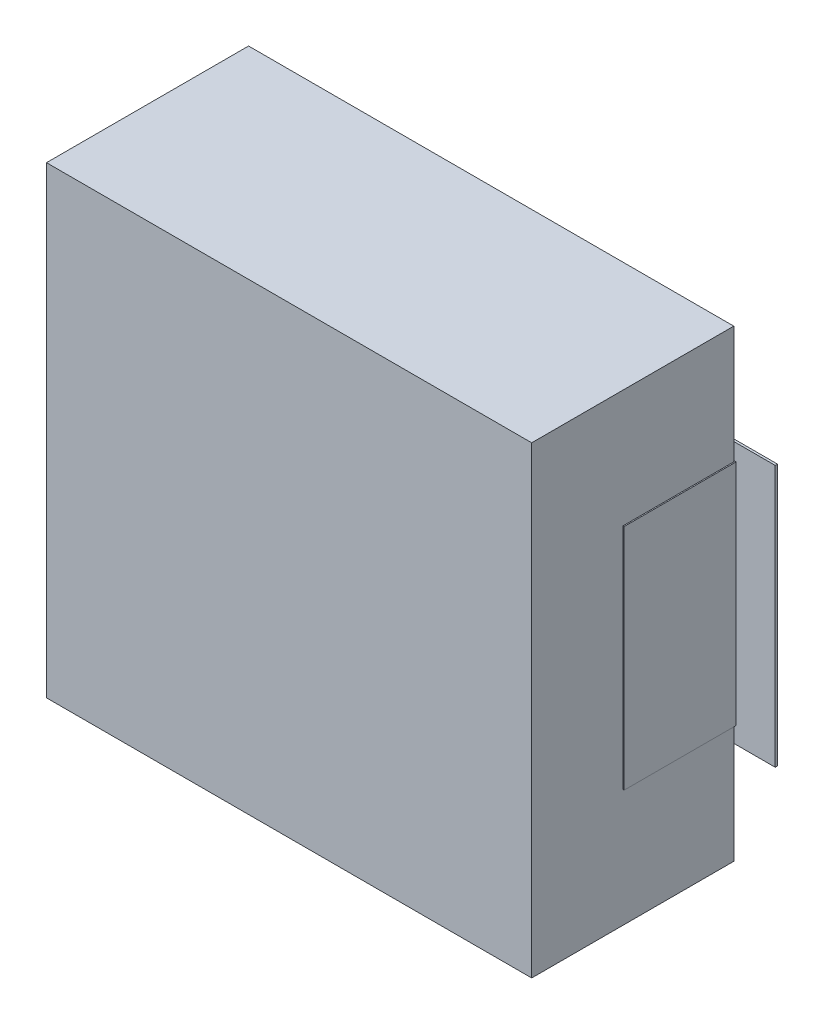
ISO-10303-21;
HEADER;
FILE_DESCRIPTION(('STEP AP214'),'2;1');
FILE_NAME('part.step','',(''),(''),'','','');
FILE_SCHEMA(('AUTOMOTIVE_DESIGN { 1 0 10303 214 1 1 1 1 }'));
ENDSEC;
DATA;
#1=APPLICATION_CONTEXT('core data for automotive mechanical design processes');
#2=APPLICATION_PROTOCOL_DEFINITION('international standard','automotive_design',2000,#1);
#3=PRODUCT_CONTEXT('',#1,'mechanical');
#4=PRODUCT('Part','Part','',(#3));
#5=PRODUCT_RELATED_PRODUCT_CATEGORY('part','',(#4));
#6=PRODUCT_DEFINITION_FORMATION('','',#4);
#7=PRODUCT_DEFINITION_CONTEXT('part definition',#1,'design');
#8=PRODUCT_DEFINITION('design','',#6,#7);
#9=PRODUCT_DEFINITION_SHAPE('','',#8);
#10=(LENGTH_UNIT() NAMED_UNIT(*) SI_UNIT(.MILLI.,.METRE.));
#11=(NAMED_UNIT(*) PLANE_ANGLE_UNIT() SI_UNIT($,.RADIAN.));
#12=(NAMED_UNIT(*) SI_UNIT($,.STERADIAN.) SOLID_ANGLE_UNIT());
#13=UNCERTAINTY_MEASURE_WITH_UNIT(LENGTH_MEASURE(1.E-05),#10,'distance_accuracy_value','');
#14=(GEOMETRIC_REPRESENTATION_CONTEXT(3) GLOBAL_UNCERTAINTY_ASSIGNED_CONTEXT((#13)) GLOBAL_UNIT_ASSIGNED_CONTEXT((#10,
#11,#12)) REPRESENTATION_CONTEXT('',''));
#15=CARTESIAN_POINT('',(0.,0.,0.));
#16=DIRECTION('',(0.,0.,1.));
#17=DIRECTION('',(1.,0.,0.));
#18=AXIS2_PLACEMENT_3D('',#15,#16,#17);
#19=CARTESIAN_POINT('',(1.375,-1.,0.0762));
#20=DIRECTION('',(0.,-1.,0.));
#21=DIRECTION('',(0.,0.,-1.));
#22=AXIS2_PLACEMENT_3D('',#19,#20,#21);
#23=PLANE('',#22);
#24=DIRECTION('',(0.,0.,-1.));
#25=VECTOR('',#24,1.);
#26=CARTESIAN_POINT('',(2.135,-1.,1.0762));
#27=LINE('',#26,#25);
#28=CARTESIAN_POINT('',(2.135,-1.,1.0762));
#29=VERTEX_POINT('',#28);
#30=CARTESIAN_POINT('',(2.135,-1.,0.0962));
#31=VERTEX_POINT('',#30);
#32=EDGE_CURVE('E21',#29,#31,#27,.T.);
#33=ORIENTED_EDGE('',*,*,#32,.F.);
#34=DIRECTION('',(-1.,0.,0.));
#35=VECTOR('',#34,1.);
#36=CARTESIAN_POINT('',(2.135,-1.,1.0762));
#37=LINE('',#36,#35);
#38=CARTESIAN_POINT('',(2.125,-1.,1.0762));
#39=VERTEX_POINT('',#38);
#40=EDGE_CURVE('E316',#29,#39,#37,.T.);
#41=ORIENTED_EDGE('',*,*,#40,.T.);
#42=DIRECTION('',(0.,0.,-1.));
#43=VECTOR('',#42,1.);
#44=CARTESIAN_POINT('',(2.125,-1.,1.0762));
#45=LINE('',#44,#43);
#46=CARTESIAN_POINT('',(2.125,-1.,0.1062));
#47=VERTEX_POINT('',#46);
#48=EDGE_CURVE('E275',#39,#47,#45,.T.);
#49=ORIENTED_EDGE('',*,*,#48,.T.);
#50=DIRECTION('',(-1.,0.,0.));
#51=VECTOR('',#50,1.);
#52=CARTESIAN_POINT('',(2.125,-1.,0.1062));
#53=LINE('',#52,#51);
#54=CARTESIAN_POINT('',(1.375,-1.,0.1062));
#55=VERTEX_POINT('',#54);
#56=EDGE_CURVE('E270',#47,#55,#53,.T.);
#57=ORIENTED_EDGE('',*,*,#56,.T.);
#58=DIRECTION('',(0.,0.,1.));
#59=VECTOR('',#58,1.);
#60=CARTESIAN_POINT('',(1.375,-1.,0.0962));
#61=LINE('',#60,#59);
#62=CARTESIAN_POINT('',(1.375,-1.,0.0962));
#63=VERTEX_POINT('',#62);
#64=EDGE_CURVE('E495',#63,#55,#61,.T.);
#65=ORIENTED_EDGE('',*,*,#64,.F.);
#66=DIRECTION('',(1.,0.,0.));
#67=VECTOR('',#66,1.);
#68=CARTESIAN_POINT('',(1.375,-1.,0.0962));
#69=LINE('',#68,#67);
#70=EDGE_CURVE('E323',#63,#31,#69,.T.);
#71=ORIENTED_EDGE('',*,*,#70,.T.);
#72=EDGE_LOOP('',(#33,#41,#49,#57,#65,#71));
#73=FACE_BOUND('',#72,.T.);
#74=ADVANCED_FACE('F17',(#73),#23,.T.);
#75=CARTESIAN_POINT('',(-2.225,-2.03,0.0762));
#76=DIRECTION('',(0.,-1.,0.));
#77=DIRECTION('',(0.,0.,-1.));
#78=AXIS2_PLACEMENT_3D('',#75,#76,#77);
#79=PLANE('',#78);
#80=DIRECTION('',(1.,0.,0.));
#81=VECTOR('',#80,1.);
#82=CARTESIAN_POINT('',(-2.125,-2.03,0.1062));
#83=LINE('',#82,#81);
#84=CARTESIAN_POINT('',(-2.125,-2.03,0.1062));
#85=VERTEX_POINT('',#84);
#86=CARTESIAN_POINT('',(2.125,-2.03,0.1062));
#87=VERTEX_POINT('',#86);
#88=EDGE_CURVE('E317',#85,#87,#83,.T.);
#89=ORIENTED_EDGE('',*,*,#88,.T.);
#90=DIRECTION('',(0.,0.,1.));
#91=VECTOR('',#90,1.);
#92=CARTESIAN_POINT('',(2.125,-2.03,0.1062));
#93=LINE('',#92,#91);
#94=CARTESIAN_POINT('',(2.125,-2.03,1.8762));
#95=VERTEX_POINT('',#94);
#96=EDGE_CURVE('E276',#87,#95,#93,.T.);
#97=ORIENTED_EDGE('',*,*,#96,.T.);
#98=DIRECTION('',(1.,0.,0.));
#99=VECTOR('',#98,1.);
#100=CARTESIAN_POINT('',(-2.125,-2.03,1.8762));
#101=LINE('',#100,#99);
#102=CARTESIAN_POINT('',(-2.125,-2.03,1.8762));
#103=VERTEX_POINT('',#102);
#104=EDGE_CURVE('E481',#103,#95,#101,.T.);
#105=ORIENTED_EDGE('',*,*,#104,.F.);
#106=DIRECTION('',(0.,0.,1.));
#107=VECTOR('',#106,1.);
#108=CARTESIAN_POINT('',(-2.125,-2.03,0.1062));
#109=LINE('',#108,#107);
#110=EDGE_CURVE('E400',#85,#103,#109,.T.);
#111=ORIENTED_EDGE('',*,*,#110,.F.);
#112=EDGE_LOOP('',(#89,#97,#105,#111));
#113=FACE_BOUND('',#112,.T.);
#114=ADVANCED_FACE('F541',(#113),#79,.T.);
#115=CARTESIAN_POINT('',(-1.375,-1.,0.0762));
#116=DIRECTION('',(1.,0.,0.));
#117=DIRECTION('',(0.,1.,0.));
#118=AXIS2_PLACEMENT_3D('',#115,#116,#117);
#119=PLANE('',#118);
#120=DIRECTION('',(0.,1.,0.));
#121=VECTOR('',#120,1.);
#122=CARTESIAN_POINT('',(-1.375,-1.,0.0962));
#123=LINE('',#122,#121);
#124=CARTESIAN_POINT('',(-1.375,-1.,0.0962));
#125=VERTEX_POINT('',#124);
#126=CARTESIAN_POINT('',(-1.375,1.,0.0962));
#127=VERTEX_POINT('',#126);
#128=EDGE_CURVE('E305',#125,#127,#123,.T.);
#129=ORIENTED_EDGE('',*,*,#128,.T.);
#130=DIRECTION('',(0.,0.,1.));
#131=VECTOR('',#130,1.);
#132=CARTESIAN_POINT('',(-1.375,1.,0.0962));
#133=LINE('',#132,#131);
#134=CARTESIAN_POINT('',(-1.375,1.,0.1062));
#135=VERTEX_POINT('',#134);
#136=EDGE_CURVE('E353',#127,#135,#133,.T.);
#137=ORIENTED_EDGE('',*,*,#136,.T.);
#138=DIRECTION('',(0.,1.,0.));
#139=VECTOR('',#138,1.);
#140=CARTESIAN_POINT('',(-1.375,-1.,0.1062));
#141=LINE('',#140,#139);
#142=CARTESIAN_POINT('',(-1.375,-1.,0.1062));
#143=VERTEX_POINT('',#142);
#144=EDGE_CURVE('E300',#143,#135,#141,.T.);
#145=ORIENTED_EDGE('',*,*,#144,.F.);
#146=DIRECTION('',(0.,0.,1.));
#147=VECTOR('',#146,1.);
#148=CARTESIAN_POINT('',(-1.375,-1.,0.0962));
#149=LINE('',#148,#147);
#150=EDGE_CURVE('E11',#125,#143,#149,.T.);
#151=ORIENTED_EDGE('',*,*,#150,.F.);
#152=EDGE_LOOP('',(#129,#137,#145,#151));
#153=FACE_BOUND('',#152,.T.);
#154=ADVANCED_FACE('F550',(#153),#119,.T.);
#155=CARTESIAN_POINT('',(-2.135,-1.,0.0762));
#156=DIRECTION('',(0.,-1.,0.));
#157=DIRECTION('',(0.,0.,-1.));
#158=AXIS2_PLACEMENT_3D('',#155,#156,#157);
#159=PLANE('',#158);
#160=DIRECTION('',(0.,0.,-1.));
#161=VECTOR('',#160,1.);
#162=CARTESIAN_POINT('',(-2.135,-1.,1.0762));
#163=LINE('',#162,#161);
#164=CARTESIAN_POINT('',(-2.135,-1.,1.0762));
#165=VERTEX_POINT('',#164);
#166=CARTESIAN_POINT('',(-2.135,-1.,0.0962));
#167=VERTEX_POINT('',#166);
#168=EDGE_CURVE('E28',#165,#167,#163,.T.);
#169=ORIENTED_EDGE('',*,*,#168,.T.);
#170=DIRECTION('',(1.,0.,0.));
#171=VECTOR('',#170,1.);
#172=CARTESIAN_POINT('',(-2.135,-1.,0.0962));
#173=LINE('',#172,#171);
#174=EDGE_CURVE('E422',#167,#125,#173,.T.);
#175=ORIENTED_EDGE('',*,*,#174,.T.);
#176=ORIENTED_EDGE('',*,*,#150,.T.);
#177=DIRECTION('',(1.,0.,0.));
#178=VECTOR('',#177,1.);
#179=CARTESIAN_POINT('',(-2.125,-1.,0.1062));
#180=LINE('',#179,#178);
#181=CARTESIAN_POINT('',(-2.125,-1.,0.1062));
#182=VERTEX_POINT('',#181);
#183=EDGE_CURVE('E327',#182,#143,#180,.T.);
#184=ORIENTED_EDGE('',*,*,#183,.F.);
#185=DIRECTION('',(0.,0.,-1.));
#186=VECTOR('',#185,1.);
#187=CARTESIAN_POINT('',(-2.125,-1.,1.0762));
#188=LINE('',#187,#186);
#189=CARTESIAN_POINT('',(-2.125,-1.,1.0762));
#190=VERTEX_POINT('',#189);
#191=EDGE_CURVE('E455',#190,#182,#188,.T.);
#192=ORIENTED_EDGE('',*,*,#191,.F.);
#193=DIRECTION('',(-1.,0.,0.));
#194=VECTOR('',#193,1.);
#195=CARTESIAN_POINT('',(-2.125,-1.,1.0762));
#196=LINE('',#195,#194);
#197=EDGE_CURVE('E386',#190,#165,#196,.T.);
#198=ORIENTED_EDGE('',*,*,#197,.T.);
#199=EDGE_LOOP('',(#169,#175,#176,#184,#192,#198));
#200=FACE_BOUND('',#199,.T.);
#201=ADVANCED_FACE('F624',(#200),#159,.T.);
#202=CARTESIAN_POINT('',(-2.135,1.,0.0762));
#203=DIRECTION('',(-1.,0.,0.));
#204=DIRECTION('',(0.,0.,1.));
#205=AXIS2_PLACEMENT_3D('',#202,#203,#204);
#206=PLANE('',#205);
#207=DIRECTION('',(0.,0.,-1.));
#208=VECTOR('',#207,1.);
#209=CARTESIAN_POINT('',(-2.135,1.,1.0762));
#210=LINE('',#209,#208);
#211=CARTESIAN_POINT('',(-2.135,1.,1.0762));
#212=VERTEX_POINT('',#211);
#213=CARTESIAN_POINT('',(-2.135,1.,0.0962));
#214=VERTEX_POINT('',#213);
#215=EDGE_CURVE('E399',#212,#214,#210,.T.);
#216=ORIENTED_EDGE('',*,*,#215,.T.);
#217=DIRECTION('',(0.,-1.,0.));
#218=VECTOR('',#217,1.);
#219=CARTESIAN_POINT('',(-2.135,1.,0.0962));
#220=LINE('',#219,#218);
#221=EDGE_CURVE('E306',#214,#167,#220,.T.);
#222=ORIENTED_EDGE('',*,*,#221,.T.);
#223=ORIENTED_EDGE('',*,*,#168,.F.);
#224=DIRECTION('',(0.,1.,0.));
#225=VECTOR('',#224,1.);
#226=CARTESIAN_POINT('',(-2.135,-1.,1.0762));
#227=LINE('',#226,#225);
#228=EDGE_CURVE('E407',#165,#212,#227,.T.);
#229=ORIENTED_EDGE('',*,*,#228,.T.);
#230=EDGE_LOOP('',(#216,#222,#223,#229));
#231=FACE_BOUND('',#230,.T.);
#232=ADVANCED_FACE('F555',(#231),#206,.T.);
#233=CARTESIAN_POINT('',(-1.375,1.,0.0762));
#234=DIRECTION('',(0.,1.,0.));
#235=DIRECTION('',(1.,0.,0.));
#236=AXIS2_PLACEMENT_3D('',#233,#234,#235);
#237=PLANE('',#236);
#238=ORIENTED_EDGE('',*,*,#215,.F.);
#239=DIRECTION('',(1.,0.,0.));
#240=VECTOR('',#239,1.);
#241=CARTESIAN_POINT('',(-2.135,1.,1.0762));
#242=LINE('',#241,#240);
#243=CARTESIAN_POINT('',(-2.125,1.,1.0762));
#244=VERTEX_POINT('',#243);
#245=EDGE_CURVE('E359',#212,#244,#242,.T.);
#246=ORIENTED_EDGE('',*,*,#245,.T.);
#247=DIRECTION('',(0.,0.,-1.));
#248=VECTOR('',#247,1.);
#249=CARTESIAN_POINT('',(-2.125,1.,1.0762));
#250=LINE('',#249,#248);
#251=CARTESIAN_POINT('',(-2.125,1.,0.1062));
#252=VERTEX_POINT('',#251);
#253=EDGE_CURVE('E396',#244,#252,#250,.T.);
#254=ORIENTED_EDGE('',*,*,#253,.T.);
#255=DIRECTION('',(1.,0.,0.));
#256=VECTOR('',#255,1.);
#257=CARTESIAN_POINT('',(-2.125,1.,0.1062));
#258=LINE('',#257,#256);
#259=EDGE_CURVE('E295',#252,#135,#258,.T.);
#260=ORIENTED_EDGE('',*,*,#259,.T.);
#261=ORIENTED_EDGE('',*,*,#136,.F.);
#262=DIRECTION('',(-1.,0.,0.));
#263=VECTOR('',#262,1.);
#264=CARTESIAN_POINT('',(-1.375,1.,0.0962));
#265=LINE('',#264,#263);
#266=EDGE_CURVE('E301',#127,#214,#265,.T.);
#267=ORIENTED_EDGE('',*,*,#266,.T.);
#268=EDGE_LOOP('',(#238,#246,#254,#260,#261,#267));
#269=FACE_BOUND('',#268,.T.);
#270=ADVANCED_FACE('F639',(#269),#237,.T.);
#271=CARTESIAN_POINT('',(-2.125,-2.03,1.8762));
#272=DIRECTION('',(1.,0.,0.));
#273=DIRECTION('',(0.,1.,0.));
#274=AXIS2_PLACEMENT_3D('',#271,#272,#273);
#275=PLANE('',#274);
#276=DIRECTION('',(0.,-1.,0.));
#277=VECTOR('',#276,1.);
#278=CARTESIAN_POINT('',(-2.125,1.,1.0762));
#279=LINE('',#278,#277);
#280=EDGE_CURVE('E355',#244,#190,#279,.T.);
#281=ORIENTED_EDGE('',*,*,#280,.T.);
#282=ORIENTED_EDGE('',*,*,#191,.T.);
#283=DIRECTION('',(0.,-1.,0.));
#284=VECTOR('',#283,1.);
#285=CARTESIAN_POINT('',(-2.125,-1.,0.1062));
#286=LINE('',#285,#284);
#287=EDGE_CURVE('E320',#182,#85,#286,.T.);
#288=ORIENTED_EDGE('',*,*,#287,.T.);
#289=ORIENTED_EDGE('',*,*,#110,.T.);
#290=DIRECTION('',(0.,1.,0.));
#291=VECTOR('',#290,1.);
#292=CARTESIAN_POINT('',(-2.125,-2.03,1.8762));
#293=LINE('',#292,#291);
#294=CARTESIAN_POINT('',(-2.125,2.03,1.8762));
#295=VERTEX_POINT('',#294);
#296=EDGE_CURVE('E415',#103,#295,#293,.T.);
#297=ORIENTED_EDGE('',*,*,#296,.T.);
#298=DIRECTION('',(0.,0.,1.));
#299=VECTOR('',#298,1.);
#300=CARTESIAN_POINT('',(-2.125,2.03,0.1062));
#301=LINE('',#300,#299);
#302=CARTESIAN_POINT('',(-2.125,2.03,0.1062));
#303=VERTEX_POINT('',#302);
#304=EDGE_CURVE('E42',#303,#295,#301,.T.);
#305=ORIENTED_EDGE('',*,*,#304,.F.);
#306=DIRECTION('',(0.,-1.,0.));
#307=VECTOR('',#306,1.);
#308=CARTESIAN_POINT('',(-2.125,2.03,0.1062));
#309=LINE('',#308,#307);
#310=EDGE_CURVE('E299',#303,#252,#309,.T.);
#311=ORIENTED_EDGE('',*,*,#310,.T.);
#312=ORIENTED_EDGE('',*,*,#253,.F.);
#313=EDGE_LOOP('',(#281,#282,#288,#289,#297,#305,#311,#312));
#314=FACE_BOUND('',#313,.T.);
#315=ADVANCED_FACE('F651',(#314),#275,.F.);
#316=CARTESIAN_POINT('',(2.225,2.03,0.0762));
#317=DIRECTION('',(0.,1.,0.));
#318=DIRECTION('',(1.,0.,0.));
#319=AXIS2_PLACEMENT_3D('',#316,#317,#318);
#320=PLANE('',#319);
#321=DIRECTION('',(-1.,0.,0.));
#322=VECTOR('',#321,1.);
#323=CARTESIAN_POINT('',(2.125,2.03,0.1062));
#324=LINE('',#323,#322);
#325=CARTESIAN_POINT('',(2.125,2.03,0.1062));
#326=VERTEX_POINT('',#325);
#327=EDGE_CURVE('E456',#326,#303,#324,.T.);
#328=ORIENTED_EDGE('',*,*,#327,.T.);
#329=ORIENTED_EDGE('',*,*,#304,.T.);
#330=DIRECTION('',(-1.,0.,0.));
#331=VECTOR('',#330,1.);
#332=CARTESIAN_POINT('',(2.125,2.03,1.8762));
#333=LINE('',#332,#331);
#334=CARTESIAN_POINT('',(2.125,2.03,1.8762));
#335=VERTEX_POINT('',#334);
#336=EDGE_CURVE('E374',#335,#295,#333,.T.);
#337=ORIENTED_EDGE('',*,*,#336,.F.);
#338=DIRECTION('',(0.,0.,1.));
#339=VECTOR('',#338,1.);
#340=CARTESIAN_POINT('',(2.125,2.03,0.1062));
#341=LINE('',#340,#339);
#342=EDGE_CURVE('E311',#326,#335,#341,.T.);
#343=ORIENTED_EDGE('',*,*,#342,.F.);
#344=EDGE_LOOP('',(#328,#329,#337,#343));
#345=FACE_BOUND('',#344,.T.);
#346=ADVANCED_FACE('F691',(#345),#320,.T.);
#347=CARTESIAN_POINT('',(0.,0.,0.1062));
#348=DIRECTION('',(0.,0.,-1.));
#349=DIRECTION('',(0.,-1.,0.));
#350=AXIS2_PLACEMENT_3D('',#347,#348,#349);
#351=PLANE('',#350);
#352=DIRECTION('',(0.,-1.,0.));
#353=VECTOR('',#352,1.);
#354=CARTESIAN_POINT('',(2.125,2.03,0.1062));
#355=LINE('',#354,#353);
#356=CARTESIAN_POINT('',(2.125,1.,0.1062));
#357=VERTEX_POINT('',#356);
#358=EDGE_CURVE('E307',#326,#357,#355,.T.);
#359=ORIENTED_EDGE('',*,*,#358,.T.);
#360=DIRECTION('',(-1.,0.,0.));
#361=VECTOR('',#360,1.);
#362=CARTESIAN_POINT('',(2.125,1.,0.1062));
#363=LINE('',#362,#361);
#364=CARTESIAN_POINT('',(1.375,1.,0.1062));
#365=VERTEX_POINT('',#364);
#366=EDGE_CURVE('E329',#357,#365,#363,.T.);
#367=ORIENTED_EDGE('',*,*,#366,.T.);
#368=DIRECTION('',(0.,-1.,0.));
#369=VECTOR('',#368,1.);
#370=CARTESIAN_POINT('',(1.375,1.,0.1062));
#371=LINE('',#370,#369);
#372=EDGE_CURVE('E500',#365,#55,#371,.T.);
#373=ORIENTED_EDGE('',*,*,#372,.T.);
#374=ORIENTED_EDGE('',*,*,#56,.F.);
#375=DIRECTION('',(0.,-1.,0.));
#376=VECTOR('',#375,1.);
#377=CARTESIAN_POINT('',(2.125,-1.,0.1062));
#378=LINE('',#377,#376);
#379=EDGE_CURVE('E272',#47,#87,#378,.T.);
#380=ORIENTED_EDGE('',*,*,#379,.T.);
#381=ORIENTED_EDGE('',*,*,#88,.F.);
#382=ORIENTED_EDGE('',*,*,#287,.F.);
#383=ORIENTED_EDGE('',*,*,#183,.T.);
#384=ORIENTED_EDGE('',*,*,#144,.T.);
#385=ORIENTED_EDGE('',*,*,#259,.F.);
#386=ORIENTED_EDGE('',*,*,#310,.F.);
#387=ORIENTED_EDGE('',*,*,#327,.F.);
#388=EDGE_LOOP('',(#359,#367,#373,#374,#380,#381,#382,#383,#384,#385,#386,#387));
#389=FACE_BOUND('',#388,.T.);
#390=ADVANCED_FACE('F536',(#389),#351,.T.);
#391=CARTESIAN_POINT('',(1.375,1.,0.0762));
#392=DIRECTION('',(-1.,0.,0.));
#393=DIRECTION('',(0.,0.,1.));
#394=AXIS2_PLACEMENT_3D('',#391,#392,#393);
#395=PLANE('',#394);
#396=DIRECTION('',(0.,-1.,0.));
#397=VECTOR('',#396,1.);
#398=CARTESIAN_POINT('',(1.375,1.,0.0962));
#399=LINE('',#398,#397);
#400=CARTESIAN_POINT('',(1.375,1.,0.0962));
#401=VERTEX_POINT('',#400);
#402=EDGE_CURVE('E366',#401,#63,#399,.T.);
#403=ORIENTED_EDGE('',*,*,#402,.T.);
#404=ORIENTED_EDGE('',*,*,#64,.T.);
#405=ORIENTED_EDGE('',*,*,#372,.F.);
#406=DIRECTION('',(0.,0.,1.));
#407=VECTOR('',#406,1.);
#408=CARTESIAN_POINT('',(1.375,1.,0.0962));
#409=LINE('',#408,#407);
#410=EDGE_CURVE('E332',#401,#365,#409,.T.);
#411=ORIENTED_EDGE('',*,*,#410,.F.);
#412=EDGE_LOOP('',(#403,#404,#405,#411));
#413=FACE_BOUND('',#412,.T.);
#414=ADVANCED_FACE('F527',(#413),#395,.T.);
#415=CARTESIAN_POINT('',(2.478,-1.145,0.0762));
#416=DIRECTION('',(1.,0.,0.));
#417=DIRECTION('',(0.,1.,0.));
#418=AXIS2_PLACEMENT_3D('',#415,#416,#417);
#419=PLANE('',#418);
#420=DIRECTION('',(0.,1.,0.));
#421=VECTOR('',#420,1.);
#422=CARTESIAN_POINT('',(2.478,-1.145,0.0762));
#423=LINE('',#422,#421);
#424=CARTESIAN_POINT('',(2.478,-1.145,0.0762));
#425=VERTEX_POINT('',#424);
#426=CARTESIAN_POINT('',(2.478,1.145,0.0762));
#427=VERTEX_POINT('',#426);
#428=EDGE_CURVE('E285',#425,#427,#423,.T.);
#429=ORIENTED_EDGE('',*,*,#428,.T.);
#430=DIRECTION('',(0.,0.,1.));
#431=VECTOR('',#430,1.);
#432=CARTESIAN_POINT('',(2.478,1.145,0.0762));
#433=LINE('',#432,#431);
#434=CARTESIAN_POINT('',(2.478,1.145,0.0962));
#435=VERTEX_POINT('',#434);
#436=EDGE_CURVE('E383',#427,#435,#433,.T.);
#437=ORIENTED_EDGE('',*,*,#436,.T.);
#438=DIRECTION('',(0.,1.,0.));
#439=VECTOR('',#438,1.);
#440=CARTESIAN_POINT('',(2.478,-1.145,0.0962));
#441=LINE('',#440,#439);
#442=CARTESIAN_POINT('',(2.478,-1.145,0.0962));
#443=VERTEX_POINT('',#442);
#444=EDGE_CURVE('E255',#443,#435,#441,.T.);
#445=ORIENTED_EDGE('',*,*,#444,.F.);
#446=DIRECTION('',(0.,0.,1.));
#447=VECTOR('',#446,1.);
#448=CARTESIAN_POINT('',(2.478,-1.145,0.0762));
#449=LINE('',#448,#447);
#450=EDGE_CURVE('E245',#425,#443,#449,.T.);
#451=ORIENTED_EDGE('',*,*,#450,.F.);
#452=EDGE_LOOP('',(#429,#437,#445,#451));
#453=FACE_BOUND('',#452,.T.);
#454=ADVANCED_FACE('F525',(#453),#419,.T.);
#455=CARTESIAN_POINT('',(1.078,-1.145,0.0762));
#456=DIRECTION('',(0.,-1.,0.));
#457=DIRECTION('',(0.,0.,-1.));
#458=AXIS2_PLACEMENT_3D('',#455,#456,#457);
#459=PLANE('',#458);
#460=DIRECTION('',(1.,0.,0.));
#461=VECTOR('',#460,1.);
#462=CARTESIAN_POINT('',(1.078,-1.145,0.0762));
#463=LINE('',#462,#461);
#464=CARTESIAN_POINT('',(1.078,-1.145,0.0762));
#465=VERTEX_POINT('',#464);
#466=EDGE_CURVE('E278',#465,#425,#463,.T.);
#467=ORIENTED_EDGE('',*,*,#466,.T.);
#468=ORIENTED_EDGE('',*,*,#450,.T.);
#469=DIRECTION('',(1.,0.,0.));
#470=VECTOR('',#469,1.);
#471=CARTESIAN_POINT('',(1.078,-1.145,0.0962));
#472=LINE('',#471,#470);
#473=CARTESIAN_POINT('',(1.078,-1.145,0.0962));
#474=VERTEX_POINT('',#473);
#475=EDGE_CURVE('E249',#474,#443,#472,.T.);
#476=ORIENTED_EDGE('',*,*,#475,.F.);
#477=DIRECTION('',(0.,0.,1.));
#478=VECTOR('',#477,1.);
#479=CARTESIAN_POINT('',(1.078,-1.145,0.0762));
#480=LINE('',#479,#478);
#481=EDGE_CURVE('E233',#465,#474,#480,.T.);
#482=ORIENTED_EDGE('',*,*,#481,.F.);
#483=EDGE_LOOP('',(#467,#468,#476,#482));
#484=FACE_BOUND('',#483,.T.);
#485=ADVANCED_FACE('F250',(#484),#459,.T.);
#486=CARTESIAN_POINT('',(1.078,1.145,0.0762));
#487=DIRECTION('',(-1.,0.,0.));
#488=DIRECTION('',(0.,0.,1.));
#489=AXIS2_PLACEMENT_3D('',#486,#487,#488);
#490=PLANE('',#489);
#491=DIRECTION('',(0.,-1.,0.));
#492=VECTOR('',#491,1.);
#493=CARTESIAN_POINT('',(1.078,1.145,0.0762));
#494=LINE('',#493,#492);
#495=CARTESIAN_POINT('',(1.078,1.145,0.0762));
#496=VERTEX_POINT('',#495);
#497=EDGE_CURVE('E240',#496,#465,#494,.T.);
#498=ORIENTED_EDGE('',*,*,#497,.T.);
#499=ORIENTED_EDGE('',*,*,#481,.T.);
#500=DIRECTION('',(0.,-1.,0.));
#501=VECTOR('',#500,1.);
#502=CARTESIAN_POINT('',(1.078,1.145,0.0962));
#503=LINE('',#502,#501);
#504=CARTESIAN_POINT('',(1.078,1.145,0.0962));
#505=VERTEX_POINT('',#504);
#506=EDGE_CURVE('E238',#505,#474,#503,.T.);
#507=ORIENTED_EDGE('',*,*,#506,.F.);
#508=DIRECTION('',(0.,0.,1.));
#509=VECTOR('',#508,1.);
#510=CARTESIAN_POINT('',(1.078,1.145,0.0762));
#511=LINE('',#510,#509);
#512=EDGE_CURVE('E402',#496,#505,#511,.T.);
#513=ORIENTED_EDGE('',*,*,#512,.F.);
#514=EDGE_LOOP('',(#498,#499,#507,#513));
#515=FACE_BOUND('',#514,.T.);
#516=ADVANCED_FACE('F235',(#515),#490,.T.);
#517=CARTESIAN_POINT('',(-2.478,1.145,0.0762));
#518=DIRECTION('',(-1.,0.,0.));
#519=DIRECTION('',(0.,0.,1.));
#520=AXIS2_PLACEMENT_3D('',#517,#518,#519);
#521=PLANE('',#520);
#522=DIRECTION('',(0.,-1.,0.));
#523=VECTOR('',#522,1.);
#524=CARTESIAN_POINT('',(-2.478,1.145,0.0762));
#525=LINE('',#524,#523);
#526=CARTESIAN_POINT('',(-2.478,1.145,0.0762));
#527=VERTEX_POINT('',#526);
#528=CARTESIAN_POINT('',(-2.478,-1.145,0.0762));
#529=VERTEX_POINT('',#528);
#530=EDGE_CURVE('E291',#527,#529,#525,.T.);
#531=ORIENTED_EDGE('',*,*,#530,.T.);
#532=DIRECTION('',(0.,0.,1.));
#533=VECTOR('',#532,1.);
#534=CARTESIAN_POINT('',(-2.478,-1.145,0.0762));
#535=LINE('',#534,#533);
#536=CARTESIAN_POINT('',(-2.478,-1.145,0.0962));
#537=VERTEX_POINT('',#536);
#538=EDGE_CURVE('E246',#529,#537,#535,.T.);
#539=ORIENTED_EDGE('',*,*,#538,.T.);
#540=DIRECTION('',(0.,-1.,0.));
#541=VECTOR('',#540,1.);
#542=CARTESIAN_POINT('',(-2.478,1.145,0.0962));
#543=LINE('',#542,#541);
#544=CARTESIAN_POINT('',(-2.478,1.145,0.0962));
#545=VERTEX_POINT('',#544);
#546=EDGE_CURVE('E365',#545,#537,#543,.T.);
#547=ORIENTED_EDGE('',*,*,#546,.F.);
#548=DIRECTION('',(0.,0.,1.));
#549=VECTOR('',#548,1.);
#550=CARTESIAN_POINT('',(-2.478,1.145,0.0762));
#551=LINE('',#550,#549);
#552=EDGE_CURVE('E156',#527,#545,#551,.T.);
#553=ORIENTED_EDGE('',*,*,#552,.F.);
#554=EDGE_LOOP('',(#531,#539,#547,#553));
#555=FACE_BOUND('',#554,.T.);
#556=ADVANCED_FACE('F19',(#555),#521,.T.);
#557=CARTESIAN_POINT('',(-2.478,-1.145,0.0762));
#558=DIRECTION('',(0.,-1.,0.));
#559=DIRECTION('',(0.,0.,-1.));
#560=AXIS2_PLACEMENT_3D('',#557,#558,#559);
#561=PLANE('',#560);
#562=DIRECTION('',(1.,0.,0.));
#563=VECTOR('',#562,1.);
#564=CARTESIAN_POINT('',(-2.478,-1.145,0.0762));
#565=LINE('',#564,#563);
#566=CARTESIAN_POINT('',(-1.078,-1.145,0.0762));
#567=VERTEX_POINT('',#566);
#568=EDGE_CURVE('E390',#529,#567,#565,.T.);
#569=ORIENTED_EDGE('',*,*,#568,.T.);
#570=DIRECTION('',(0.,0.,1.));
#571=VECTOR('',#570,1.);
#572=CARTESIAN_POINT('',(-1.078,-1.145,0.0762));
#573=LINE('',#572,#571);
#574=CARTESIAN_POINT('',(-1.078,-1.145,0.0962));
#575=VERTEX_POINT('',#574);
#576=EDGE_CURVE('E142',#567,#575,#573,.T.);
#577=ORIENTED_EDGE('',*,*,#576,.T.);
#578=DIRECTION('',(1.,0.,0.));
#579=VECTOR('',#578,1.);
#580=CARTESIAN_POINT('',(-2.478,-1.145,0.0962));
#581=LINE('',#580,#579);
#582=EDGE_CURVE('E370',#537,#575,#581,.T.);
#583=ORIENTED_EDGE('',*,*,#582,.F.);
#584=ORIENTED_EDGE('',*,*,#538,.F.);
#585=EDGE_LOOP('',(#569,#577,#583,#584));
#586=FACE_BOUND('',#585,.T.);
#587=ADVANCED_FACE('F592',(#586),#561,.T.);
#588=CARTESIAN_POINT('',(-1.078,-1.145,0.0762));
#589=DIRECTION('',(1.,0.,0.));
#590=DIRECTION('',(0.,1.,0.));
#591=AXIS2_PLACEMENT_3D('',#588,#589,#590);
#592=PLANE('',#591);
#593=DIRECTION('',(0.,1.,0.));
#594=VECTOR('',#593,1.);
#595=CARTESIAN_POINT('',(-1.078,-1.145,0.0762));
#596=LINE('',#595,#594);
#597=CARTESIAN_POINT('',(-1.078,1.145,0.0762));
#598=VERTEX_POINT('',#597);
#599=EDGE_CURVE('E382',#567,#598,#596,.T.);
#600=ORIENTED_EDGE('',*,*,#599,.T.);
#601=DIRECTION('',(0.,0.,1.));
#602=VECTOR('',#601,1.);
#603=CARTESIAN_POINT('',(-1.078,1.145,0.0762));
#604=LINE('',#603,#602);
#605=CARTESIAN_POINT('',(-1.078,1.145,0.0962));
#606=VERTEX_POINT('',#605);
#607=EDGE_CURVE('E283',#598,#606,#604,.T.);
#608=ORIENTED_EDGE('',*,*,#607,.T.);
#609=DIRECTION('',(0.,1.,0.));
#610=VECTOR('',#609,1.);
#611=CARTESIAN_POINT('',(-1.078,-1.145,0.0962));
#612=LINE('',#611,#610);
#613=EDGE_CURVE('E451',#575,#606,#612,.T.);
#614=ORIENTED_EDGE('',*,*,#613,.F.);
#615=ORIENTED_EDGE('',*,*,#576,.F.);
#616=EDGE_LOOP('',(#600,#608,#614,#615));
#617=FACE_BOUND('',#616,.T.);
#618=ADVANCED_FACE('F602',(#617),#592,.T.);
#619=CARTESIAN_POINT('',(-1.078,1.145,0.0762));
#620=DIRECTION('',(0.,1.,0.));
#621=DIRECTION('',(1.,0.,0.));
#622=AXIS2_PLACEMENT_3D('',#619,#620,#621);
#623=PLANE('',#622);
#624=DIRECTION('',(-1.,0.,0.));
#625=VECTOR('',#624,1.);
#626=CARTESIAN_POINT('',(-1.078,1.145,0.0762));
#627=LINE('',#626,#625);
#628=EDGE_CURVE('E378',#598,#527,#627,.T.);
#629=ORIENTED_EDGE('',*,*,#628,.T.);
#630=ORIENTED_EDGE('',*,*,#552,.T.);
#631=DIRECTION('',(-1.,0.,0.));
#632=VECTOR('',#631,1.);
#633=CARTESIAN_POINT('',(-1.078,1.145,0.0962));
#634=LINE('',#633,#632);
#635=EDGE_CURVE('E361',#606,#545,#634,.T.);
#636=ORIENTED_EDGE('',*,*,#635,.F.);
#637=ORIENTED_EDGE('',*,*,#607,.F.);
#638=EDGE_LOOP('',(#629,#630,#636,#637));
#639=FACE_BOUND('',#638,.T.);
#640=ADVANCED_FACE('F597',(#639),#623,.T.);
#641=CARTESIAN_POINT('',(0.,0.,0.0762));
#642=DIRECTION('',(0.,0.,1.));
#643=DIRECTION('',(1.,0.,0.));
#644=AXIS2_PLACEMENT_3D('',#641,#642,#643);
#645=PLANE('',#644);
#646=DIRECTION('',(-1.,0.,0.));
#647=VECTOR('',#646,1.);
#648=CARTESIAN_POINT('',(2.478,1.145,0.0762));
#649=LINE('',#648,#647);
#650=EDGE_CURVE('E426',#427,#496,#649,.T.);
#651=ORIENTED_EDGE('',*,*,#650,.F.);
#652=ORIENTED_EDGE('',*,*,#428,.F.);
#653=ORIENTED_EDGE('',*,*,#466,.F.);
#654=ORIENTED_EDGE('',*,*,#497,.F.);
#655=EDGE_LOOP('',(#651,#652,#653,#654));
#656=FACE_BOUND('',#655,.T.);
#657=ADVANCED_FACE('F523',(#656),#645,.F.);
#658=CARTESIAN_POINT('',(0.,0.,0.0762));
#659=DIRECTION('',(0.,0.,1.));
#660=DIRECTION('',(1.,0.,0.));
#661=AXIS2_PLACEMENT_3D('',#658,#659,#660);
#662=PLANE('',#661);
#663=ORIENTED_EDGE('',*,*,#628,.F.);
#664=ORIENTED_EDGE('',*,*,#599,.F.);
#665=ORIENTED_EDGE('',*,*,#568,.F.);
#666=ORIENTED_EDGE('',*,*,#530,.F.);
#667=EDGE_LOOP('',(#663,#664,#665,#666));
#668=FACE_BOUND('',#667,.T.);
#669=ADVANCED_FACE('F601',(#668),#662,.F.);
#670=CARTESIAN_POINT('',(2.478,1.145,0.0762));
#671=DIRECTION('',(0.,1.,0.));
#672=DIRECTION('',(1.,0.,0.));
#673=AXIS2_PLACEMENT_3D('',#670,#671,#672);
#674=PLANE('',#673);
#675=ORIENTED_EDGE('',*,*,#650,.T.);
#676=ORIENTED_EDGE('',*,*,#512,.T.);
#677=DIRECTION('',(-1.,0.,0.));
#678=VECTOR('',#677,1.);
#679=CARTESIAN_POINT('',(2.478,1.145,0.0962));
#680=LINE('',#679,#678);
#681=EDGE_CURVE('E259',#435,#505,#680,.T.);
#682=ORIENTED_EDGE('',*,*,#681,.F.);
#683=ORIENTED_EDGE('',*,*,#436,.F.);
#684=EDGE_LOOP('',(#675,#676,#682,#683));
#685=FACE_BOUND('',#684,.T.);
#686=ADVANCED_FACE('F519',(#685),#674,.T.);
#687=CARTESIAN_POINT('',(0.,0.,0.0962));
#688=DIRECTION('',(0.,0.,1.));
#689=DIRECTION('',(1.,0.,0.));
#690=AXIS2_PLACEMENT_3D('',#687,#688,#689);
#691=PLANE('',#690);
#692=ORIENTED_EDGE('',*,*,#221,.F.);
#693=ORIENTED_EDGE('',*,*,#266,.F.);
#694=ORIENTED_EDGE('',*,*,#128,.F.);
#695=ORIENTED_EDGE('',*,*,#174,.F.);
#696=EDGE_LOOP('',(#692,#693,#694,#695));
#697=FACE_BOUND('',#696,.T.);
#698=ORIENTED_EDGE('',*,*,#635,.T.);
#699=ORIENTED_EDGE('',*,*,#546,.T.);
#700=ORIENTED_EDGE('',*,*,#582,.T.);
#701=ORIENTED_EDGE('',*,*,#613,.T.);
#702=EDGE_LOOP('',(#698,#699,#700,#701));
#703=FACE_BOUND('',#702,.T.);
#704=ADVANCED_FACE('F567',(#697,#703),#691,.T.);
#705=CARTESIAN_POINT('',(0.,0.,0.0962));
#706=DIRECTION('',(0.,0.,1.));
#707=DIRECTION('',(1.,0.,0.));
#708=AXIS2_PLACEMENT_3D('',#705,#706,#707);
#709=PLANE('',#708);
#710=DIRECTION('',(-1.,0.,0.));
#711=VECTOR('',#710,1.);
#712=CARTESIAN_POINT('',(2.135,1.,0.0962));
#713=LINE('',#712,#711);
#714=CARTESIAN_POINT('',(2.135,1.,0.0962));
#715=VERTEX_POINT('',#714);
#716=EDGE_CURVE('E341',#715,#401,#713,.T.);
#717=ORIENTED_EDGE('',*,*,#716,.F.);
#718=DIRECTION('',(0.,1.,0.));
#719=VECTOR('',#718,1.);
#720=CARTESIAN_POINT('',(2.135,-1.,0.0962));
#721=LINE('',#720,#719);
#722=EDGE_CURVE('E266',#31,#715,#721,.T.);
#723=ORIENTED_EDGE('',*,*,#722,.F.);
#724=ORIENTED_EDGE('',*,*,#70,.F.);
#725=ORIENTED_EDGE('',*,*,#402,.F.);
#726=EDGE_LOOP('',(#717,#723,#724,#725));
#727=FACE_BOUND('',#726,.T.);
#728=ORIENTED_EDGE('',*,*,#681,.T.);
#729=ORIENTED_EDGE('',*,*,#506,.T.);
#730=ORIENTED_EDGE('',*,*,#475,.T.);
#731=ORIENTED_EDGE('',*,*,#444,.T.);
#732=EDGE_LOOP('',(#728,#729,#730,#731));
#733=FACE_BOUND('',#732,.T.);
#734=ADVANCED_FACE('F257',(#727,#733),#709,.T.);
#735=CARTESIAN_POINT('',(2.135,-1.,0.0762));
#736=DIRECTION('',(1.,0.,0.));
#737=DIRECTION('',(0.,1.,0.));
#738=AXIS2_PLACEMENT_3D('',#735,#736,#737);
#739=PLANE('',#738);
#740=DIRECTION('',(0.,0.,-1.));
#741=VECTOR('',#740,1.);
#742=CARTESIAN_POINT('',(2.135,1.,1.0762));
#743=LINE('',#742,#741);
#744=CARTESIAN_POINT('',(2.135,1.,1.0762));
#745=VERTEX_POINT('',#744);
#746=EDGE_CURVE('E349',#745,#715,#743,.T.);
#747=ORIENTED_EDGE('',*,*,#746,.F.);
#748=DIRECTION('',(0.,-1.,0.));
#749=VECTOR('',#748,1.);
#750=CARTESIAN_POINT('',(2.135,1.,1.0762));
#751=LINE('',#750,#749);
#752=EDGE_CURVE('E416',#745,#29,#751,.T.);
#753=ORIENTED_EDGE('',*,*,#752,.T.);
#754=ORIENTED_EDGE('',*,*,#32,.T.);
#755=ORIENTED_EDGE('',*,*,#722,.T.);
#756=EDGE_LOOP('',(#747,#753,#754,#755));
#757=FACE_BOUND('',#756,.T.);
#758=ADVANCED_FACE('F557',(#757),#739,.T.);
#759=CARTESIAN_POINT('',(2.135,1.,0.0762));
#760=DIRECTION('',(0.,1.,0.));
#761=DIRECTION('',(1.,0.,0.));
#762=AXIS2_PLACEMENT_3D('',#759,#760,#761);
#763=PLANE('',#762);
#764=ORIENTED_EDGE('',*,*,#746,.T.);
#765=ORIENTED_EDGE('',*,*,#716,.T.);
#766=ORIENTED_EDGE('',*,*,#410,.T.);
#767=ORIENTED_EDGE('',*,*,#366,.F.);
#768=DIRECTION('',(0.,0.,-1.));
#769=VECTOR('',#768,1.);
#770=CARTESIAN_POINT('',(2.125,1.,1.0762));
#771=LINE('',#770,#769);
#772=CARTESIAN_POINT('',(2.125,1.,1.0762));
#773=VERTEX_POINT('',#772);
#774=EDGE_CURVE('E312',#773,#357,#771,.T.);
#775=ORIENTED_EDGE('',*,*,#774,.F.);
#776=DIRECTION('',(1.,0.,0.));
#777=VECTOR('',#776,1.);
#778=CARTESIAN_POINT('',(2.125,1.,1.0762));
#779=LINE('',#778,#777);
#780=EDGE_CURVE('E360',#773,#745,#779,.T.);
#781=ORIENTED_EDGE('',*,*,#780,.T.);
#782=EDGE_LOOP('',(#764,#765,#766,#767,#775,#781));
#783=FACE_BOUND('',#782,.T.);
#784=ADVANCED_FACE('F559',(#783),#763,.T.);
#785=CARTESIAN_POINT('',(0.,0.,1.0762));
#786=DIRECTION('',(0.,0.,1.));
#787=DIRECTION('',(1.,0.,0.));
#788=AXIS2_PLACEMENT_3D('',#785,#786,#787);
#789=PLANE('',#788);
#790=ORIENTED_EDGE('',*,*,#280,.F.);
#791=ORIENTED_EDGE('',*,*,#245,.F.);
#792=ORIENTED_EDGE('',*,*,#228,.F.);
#793=ORIENTED_EDGE('',*,*,#197,.F.);
#794=EDGE_LOOP('',(#790,#791,#792,#793));
#795=FACE_BOUND('',#794,.T.);
#796=ADVANCED_FACE('F565',(#795),#789,.T.);
#797=CARTESIAN_POINT('',(0.,0.,1.0762));
#798=DIRECTION('',(0.,0.,1.));
#799=DIRECTION('',(1.,0.,0.));
#800=AXIS2_PLACEMENT_3D('',#797,#798,#799);
#801=PLANE('',#800);
#802=DIRECTION('',(0.,-1.,0.));
#803=VECTOR('',#802,1.);
#804=CARTESIAN_POINT('',(2.125,1.,1.0762));
#805=LINE('',#804,#803);
#806=EDGE_CURVE('E477',#773,#39,#805,.T.);
#807=ORIENTED_EDGE('',*,*,#806,.T.);
#808=ORIENTED_EDGE('',*,*,#40,.F.);
#809=ORIENTED_EDGE('',*,*,#752,.F.);
#810=ORIENTED_EDGE('',*,*,#780,.F.);
#811=EDGE_LOOP('',(#807,#808,#809,#810));
#812=FACE_BOUND('',#811,.T.);
#813=ADVANCED_FACE('F578',(#812),#801,.T.);
#814=CARTESIAN_POINT('',(2.125,2.03,1.8762));
#815=DIRECTION('',(-1.,0.,0.));
#816=DIRECTION('',(0.,0.,1.));
#817=AXIS2_PLACEMENT_3D('',#814,#815,#816);
#818=PLANE('',#817);
#819=ORIENTED_EDGE('',*,*,#806,.F.);
#820=ORIENTED_EDGE('',*,*,#774,.T.);
#821=ORIENTED_EDGE('',*,*,#358,.F.);
#822=ORIENTED_EDGE('',*,*,#342,.T.);
#823=DIRECTION('',(0.,1.,0.));
#824=VECTOR('',#823,1.);
#825=CARTESIAN_POINT('',(2.125,-2.03,1.8762));
#826=LINE('',#825,#824);
#827=EDGE_CURVE('E371',#95,#335,#826,.T.);
#828=ORIENTED_EDGE('',*,*,#827,.F.);
#829=ORIENTED_EDGE('',*,*,#96,.F.);
#830=ORIENTED_EDGE('',*,*,#379,.F.);
#831=ORIENTED_EDGE('',*,*,#48,.F.);
#832=EDGE_LOOP('',(#819,#820,#821,#822,#828,#829,#830,#831));
#833=FACE_BOUND('',#832,.T.);
#834=ADVANCED_FACE('F616',(#833),#818,.F.);
#835=CARTESIAN_POINT('',(0.,0.,1.8762));
#836=DIRECTION('',(0.,0.,1.));
#837=DIRECTION('',(1.,0.,0.));
#838=AXIS2_PLACEMENT_3D('',#835,#836,#837);
#839=PLANE('',#838);
#840=ORIENTED_EDGE('',*,*,#827,.T.);
#841=ORIENTED_EDGE('',*,*,#336,.T.);
#842=ORIENTED_EDGE('',*,*,#296,.F.);
#843=ORIENTED_EDGE('',*,*,#104,.T.);
#844=EDGE_LOOP('',(#840,#841,#842,#843));
#845=FACE_BOUND('',#844,.T.);
#846=ADVANCED_FACE('F615',(#845),#839,.T.);
#847=CLOSED_SHELL('',(#74,#114,#154,#201,#232,#270,#315,#346,#390,#414,#454,#485,#516,#556,#587,
#618,#640,#657,#669,#686,#704,#734,#758,#784,#796,#813,#834,#846));
#848=MANIFOLD_SOLID_BREP('B1',#847);
#849=ADVANCED_BREP_SHAPE_REPRESENTATION('',(#18,#848),#14);
#850=SHAPE_DEFINITION_REPRESENTATION(#9,#849);
ENDSEC;
END-ISO-10303-21;
